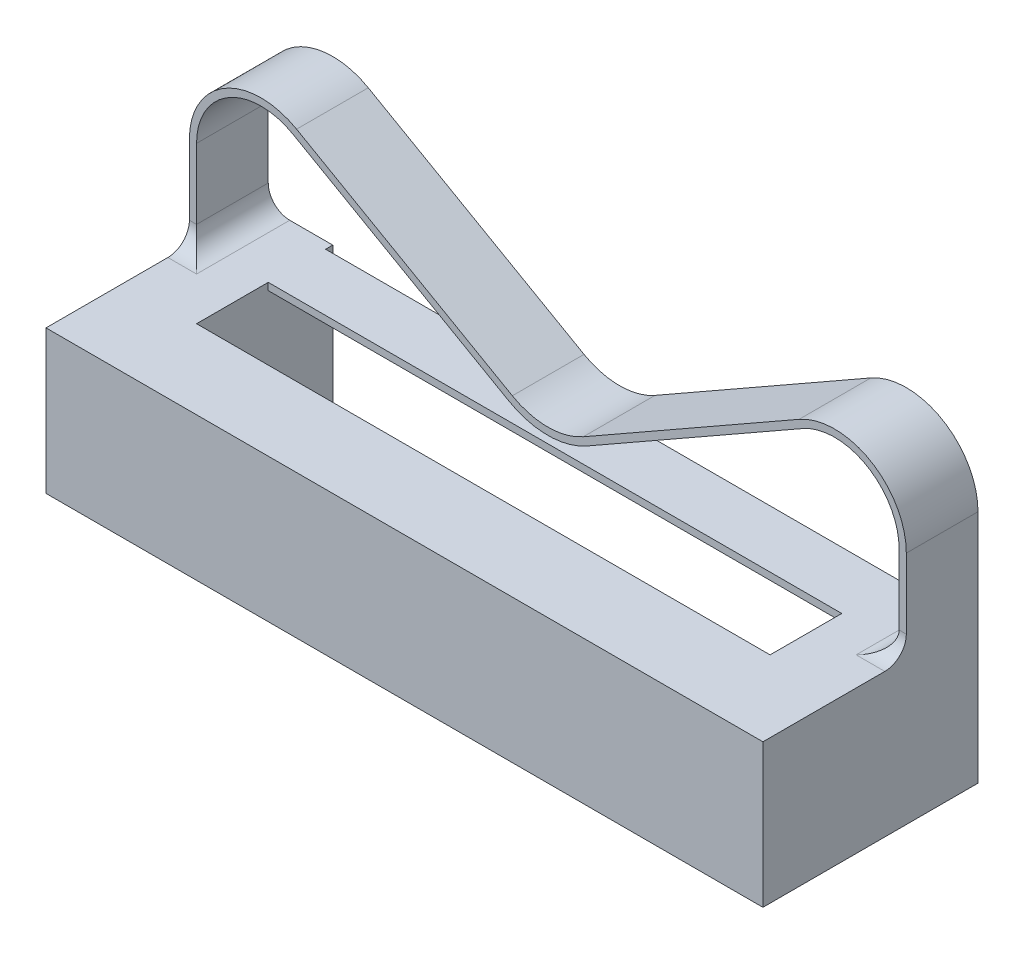
ISO-10303-21;
HEADER;
FILE_DESCRIPTION(('STEP AP214'),'2;1');
FILE_NAME('part.step','',(''),(''),'','','');
FILE_SCHEMA(('AUTOMOTIVE_DESIGN { 1 0 10303 214 1 1 1 1 }'));
ENDSEC;
DATA;
#1=APPLICATION_CONTEXT('core data for automotive mechanical design processes');
#2=APPLICATION_PROTOCOL_DEFINITION('international standard','automotive_design',2000,#1);
#3=PRODUCT_CONTEXT('',#1,'mechanical');
#4=PRODUCT('Part','Part','',(#3));
#5=PRODUCT_RELATED_PRODUCT_CATEGORY('part','',(#4));
#6=PRODUCT_DEFINITION_FORMATION('','',#4);
#7=PRODUCT_DEFINITION_CONTEXT('part definition',#1,'design');
#8=PRODUCT_DEFINITION('design','',#6,#7);
#9=PRODUCT_DEFINITION_SHAPE('','',#8);
#10=(LENGTH_UNIT() NAMED_UNIT(*) SI_UNIT(.MILLI.,.METRE.));
#11=(NAMED_UNIT(*) PLANE_ANGLE_UNIT() SI_UNIT($,.RADIAN.));
#12=(NAMED_UNIT(*) SI_UNIT($,.STERADIAN.) SOLID_ANGLE_UNIT());
#13=UNCERTAINTY_MEASURE_WITH_UNIT(LENGTH_MEASURE(1.E-05),#10,'distance_accuracy_value','');
#14=(GEOMETRIC_REPRESENTATION_CONTEXT(3) GLOBAL_UNCERTAINTY_ASSIGNED_CONTEXT((#13)) GLOBAL_UNIT_ASSIGNED_CONTEXT((#10,
#11,#12)) REPRESENTATION_CONTEXT('',''));
#15=CARTESIAN_POINT('',(0.,0.,0.));
#16=DIRECTION('',(0.,0.,1.));
#17=DIRECTION('',(1.,0.,0.));
#18=AXIS2_PLACEMENT_3D('',#15,#16,#17);
#19=CARTESIAN_POINT('',(0.,20.,50.));
#20=DIRECTION('',(0.,1.,0.));
#21=DIRECTION('',(0.,0.,1.));
#22=AXIS2_PLACEMENT_3D('',#19,#20,#21);
#23=PLANE('',#22);
#24=DIRECTION('',(0.,0.,-1.));
#25=VECTOR('',#24,1.);
#26=CARTESIAN_POINT('',(100.,20.,50.));
#27=LINE('',#26,#25);
#28=CARTESIAN_POINT('',(100.,20.,50.));
#29=VERTEX_POINT('',#28);
#30=CARTESIAN_POINT('',(100.,20.,33.));
#31=VERTEX_POINT('',#30);
#32=EDGE_CURVE('E270',#29,#31,#27,.T.);
#33=ORIENTED_EDGE('',*,*,#32,.T.);
#34=DIRECTION('',(-1.,0.,0.));
#35=VECTOR('',#34,1.);
#36=CARTESIAN_POINT('',(99.,20.,33.));
#37=LINE('',#36,#35);
#38=CARTESIAN_POINT('',(96.,20.,33.));
#39=VERTEX_POINT('',#38);
#40=EDGE_CURVE('E286',#31,#39,#37,.T.);
#41=ORIENTED_EDGE('',*,*,#40,.T.);
#42=DIRECTION('',(0.,0.,1.));
#43=VECTOR('',#42,1.);
#44=CARTESIAN_POINT('',(96.,20.,50.));
#45=LINE('',#44,#43);
#46=CARTESIAN_POINT('',(96.,20.,20.));
#47=VERTEX_POINT('',#46);
#48=EDGE_CURVE('E284',#39,#47,#45,.F.);
#49=ORIENTED_EDGE('',*,*,#48,.T.);
#50=DIRECTION('',(1.,0.,0.));
#51=VECTOR('',#50,1.);
#52=CARTESIAN_POINT('',(100.,20.,20.));
#53=LINE('',#52,#51);
#54=CARTESIAN_POINT('',(90.,20.,20.));
#55=VERTEX_POINT('',#54);
#56=EDGE_CURVE('E322',#55,#47,#53,.T.);
#57=ORIENTED_EDGE('',*,*,#56,.F.);
#58=DIRECTION('',(0.,0.,1.));
#59=VECTOR('',#58,1.);
#60=CARTESIAN_POINT('',(90.,20.,11.));
#61=LINE('',#60,#59);
#62=CARTESIAN_POINT('',(90.,20.,21.));
#63=VERTEX_POINT('',#62);
#64=EDGE_CURVE('E463',#55,#63,#61,.T.);
#65=ORIENTED_EDGE('',*,*,#64,.T.);
#66=DIRECTION('',(-1.,0.,0.));
#67=VECTOR('',#66,1.);
#68=CARTESIAN_POINT('',(9.99999999999997,20.,21.));
#69=LINE('',#68,#67);
#70=CARTESIAN_POINT('',(9.99999999999997,20.,21.));
#71=VERTEX_POINT('',#70);
#72=EDGE_CURVE('E465',#63,#71,#69,.T.);
#73=ORIENTED_EDGE('',*,*,#72,.T.);
#74=DIRECTION('',(0.,0.,-1.));
#75=VECTOR('',#74,1.);
#76=CARTESIAN_POINT('',(9.99999999999997,20.,11.));
#77=LINE('',#76,#75);
#78=CARTESIAN_POINT('',(9.99999999999998,20.,20.));
#79=VERTEX_POINT('',#78);
#80=EDGE_CURVE('E320',#71,#79,#77,.T.);
#81=ORIENTED_EDGE('',*,*,#80,.T.);
#82=CARTESIAN_POINT('',(4.,20.,20.));
#83=VERTEX_POINT('',#82);
#84=EDGE_CURVE('E317',#83,#79,#53,.T.);
#85=ORIENTED_EDGE('',*,*,#84,.F.);
#86=DIRECTION('',(0.,0.,1.));
#87=VECTOR('',#86,1.);
#88=CARTESIAN_POINT('',(4.,20.,50.));
#89=LINE('',#88,#87);
#90=CARTESIAN_POINT('',(4.,20.,33.));
#91=VERTEX_POINT('',#90);
#92=EDGE_CURVE('E281',#83,#91,#89,.T.);
#93=ORIENTED_EDGE('',*,*,#92,.T.);
#94=DIRECTION('',(-1.,0.,0.));
#95=VECTOR('',#94,1.);
#96=CARTESIAN_POINT('',(0.,20.,33.));
#97=LINE('',#96,#95);
#98=CARTESIAN_POINT('',(0.,20.,33.));
#99=VERTEX_POINT('',#98);
#100=EDGE_CURVE('E267',#91,#99,#97,.T.);
#101=ORIENTED_EDGE('',*,*,#100,.T.);
#102=DIRECTION('',(0.,0.,-1.));
#103=VECTOR('',#102,1.);
#104=CARTESIAN_POINT('',(0.,20.,50.));
#105=LINE('',#104,#103);
#106=CARTESIAN_POINT('',(0.,20.,50.));
#107=VERTEX_POINT('',#106);
#108=EDGE_CURVE('E277',#107,#99,#105,.T.);
#109=ORIENTED_EDGE('',*,*,#108,.F.);
#110=DIRECTION('',(1.,0.,0.));
#111=VECTOR('',#110,1.);
#112=CARTESIAN_POINT('',(0.,20.,50.));
#113=LINE('',#112,#111);
#114=EDGE_CURVE('E473',#107,#29,#113,.T.);
#115=ORIENTED_EDGE('',*,*,#114,.T.);
#116=EDGE_LOOP('',(#33,#41,#49,#57,#65,#73,#81,#85,#93,#101,#109,#115));
#117=FACE_BOUND('',#116,.T.);
#118=DIRECTION('',(0.,0.,1.));
#119=VECTOR('',#118,1.);
#120=CARTESIAN_POINT('',(90.,20.,39.));
#121=LINE('',#120,#119);
#122=CARTESIAN_POINT('',(90.,20.,29.));
#123=VERTEX_POINT('',#122);
#124=CARTESIAN_POINT('',(90.,20.,39.));
#125=VERTEX_POINT('',#124);
#126=EDGE_CURVE('E430',#123,#125,#121,.T.);
#127=ORIENTED_EDGE('',*,*,#126,.T.);
#128=DIRECTION('',(-1.,0.,0.));
#129=VECTOR('',#128,1.);
#130=CARTESIAN_POINT('',(9.99999999999997,20.,39.));
#131=LINE('',#130,#129);
#132=CARTESIAN_POINT('',(9.99999999999997,20.,39.));
#133=VERTEX_POINT('',#132);
#134=EDGE_CURVE('E433',#125,#133,#131,.T.);
#135=ORIENTED_EDGE('',*,*,#134,.T.);
#136=DIRECTION('',(0.,0.,-1.));
#137=VECTOR('',#136,1.);
#138=CARTESIAN_POINT('',(9.99999999999997,20.,39.));
#139=LINE('',#138,#137);
#140=CARTESIAN_POINT('',(9.99999999999997,20.,29.));
#141=VERTEX_POINT('',#140);
#142=EDGE_CURVE('E437',#133,#141,#139,.T.);
#143=ORIENTED_EDGE('',*,*,#142,.T.);
#144=DIRECTION('',(1.,0.,0.));
#145=VECTOR('',#144,1.);
#146=CARTESIAN_POINT('',(9.99999999999997,20.,29.));
#147=LINE('',#146,#145);
#148=EDGE_CURVE('E440',#141,#123,#147,.T.);
#149=ORIENTED_EDGE('',*,*,#148,.T.);
#150=EDGE_LOOP('',(#127,#135,#143,#149));
#151=FACE_BOUND('',#150,.T.);
#152=ADVANCED_FACE('F42',(#117,#151),#23,.T.);
#153=CARTESIAN_POINT('',(0.,0.,50.));
#154=DIRECTION('',(-1.,0.,0.));
#155=DIRECTION('',(0.,0.,1.));
#156=AXIS2_PLACEMENT_3D('',#153,#154,#155);
#157=PLANE('',#156);
#158=DIRECTION('',(0.,-1.,0.));
#159=VECTOR('',#158,1.);
#160=CARTESIAN_POINT('',(0.,20.,20.));
#161=LINE('',#160,#159);
#162=CARTESIAN_POINT('',(0.,32.7895699472174,20.));
#163=VERTEX_POINT('',#162);
#164=CARTESIAN_POINT('',(0.,0.,20.));
#165=VERTEX_POINT('',#164);
#166=EDGE_CURVE('E236',#163,#165,#161,.T.);
#167=ORIENTED_EDGE('',*,*,#166,.T.);
#168=DIRECTION('',(0.,0.,-1.));
#169=VECTOR('',#168,1.);
#170=CARTESIAN_POINT('',(0.,0.,50.));
#171=LINE('',#170,#169);
#172=CARTESIAN_POINT('',(0.,0.,50.));
#173=VERTEX_POINT('',#172);
#174=EDGE_CURVE('E241',#173,#165,#171,.T.);
#175=ORIENTED_EDGE('',*,*,#174,.F.);
#176=DIRECTION('',(0.,1.,0.));
#177=VECTOR('',#176,1.);
#178=CARTESIAN_POINT('',(0.,0.,50.));
#179=LINE('',#178,#177);
#180=EDGE_CURVE('E454',#173,#107,#179,.T.);
#181=ORIENTED_EDGE('',*,*,#180,.T.);
#182=ORIENTED_EDGE('',*,*,#108,.T.);
#183=CARTESIAN_POINT('',(0.,23.,33.));
#184=DIRECTION('',(-1.,0.,0.));
#185=DIRECTION('',(0.,0.,1.));
#186=AXIS2_PLACEMENT_3D('',#183,#184,#185);
#187=CIRCLE('',#186,3.);
#188=CARTESIAN_POINT('',(0.,23.,30.));
#189=VERTEX_POINT('',#188);
#190=EDGE_CURVE('E13',#99,#189,#187,.F.);
#191=ORIENTED_EDGE('',*,*,#190,.T.);
#192=DIRECTION('',(0.,-1.,0.));
#193=VECTOR('',#192,1.);
#194=CARTESIAN_POINT('',(0.,20.,30.));
#195=LINE('',#194,#193);
#196=CARTESIAN_POINT('',(0.,32.7895699472174,30.));
#197=VERTEX_POINT('',#196);
#198=EDGE_CURVE('E325',#197,#189,#195,.T.);
#199=ORIENTED_EDGE('',*,*,#198,.F.);
#200=DIRECTION('',(0.,0.,1.));
#201=VECTOR('',#200,1.);
#202=CARTESIAN_POINT('',(0.,32.7895699472174,20.));
#203=LINE('',#202,#201);
#204=EDGE_CURVE('E244',#163,#197,#203,.T.);
#205=ORIENTED_EDGE('',*,*,#204,.F.);
#206=EDGE_LOOP('',(#167,#175,#181,#182,#191,#199,#205));
#207=FACE_BOUND('',#206,.T.);
#208=ADVANCED_FACE('F238',(#207),#157,.T.);
#209=CARTESIAN_POINT('',(0.,0.,50.));
#210=DIRECTION('',(0.,1.,0.));
#211=DIRECTION('',(0.,0.,1.));
#212=AXIS2_PLACEMENT_3D('',#209,#210,#211);
#213=PLANE('',#212);
#214=ORIENTED_EDGE('',*,*,#174,.T.);
#215=DIRECTION('',(-1.,0.,0.));
#216=VECTOR('',#215,1.);
#217=CARTESIAN_POINT('',(100.,0.,20.));
#218=LINE('',#217,#216);
#219=CARTESIAN_POINT('',(9.99999999999998,0.,20.));
#220=VERTEX_POINT('',#219);
#221=EDGE_CURVE('E251',#220,#165,#218,.T.);
#222=ORIENTED_EDGE('',*,*,#221,.F.);
#223=DIRECTION('',(0.,0.,-1.));
#224=VECTOR('',#223,1.);
#225=CARTESIAN_POINT('',(9.99999999999997,0.,39.));
#226=LINE('',#225,#224);
#227=CARTESIAN_POINT('',(9.99999999999997,0.,39.));
#228=VERTEX_POINT('',#227);
#229=EDGE_CURVE('E434',#228,#220,#226,.T.);
#230=ORIENTED_EDGE('',*,*,#229,.F.);
#231=DIRECTION('',(-1.,0.,0.));
#232=VECTOR('',#231,1.);
#233=CARTESIAN_POINT('',(9.99999999999997,0.,39.));
#234=LINE('',#233,#232);
#235=CARTESIAN_POINT('',(90.,0.,39.));
#236=VERTEX_POINT('',#235);
#237=EDGE_CURVE('E446',#236,#228,#234,.T.);
#238=ORIENTED_EDGE('',*,*,#237,.F.);
#239=DIRECTION('',(0.,0.,1.));
#240=VECTOR('',#239,1.);
#241=CARTESIAN_POINT('',(90.,0.,39.));
#242=LINE('',#241,#240);
#243=CARTESIAN_POINT('',(90.,0.,20.));
#244=VERTEX_POINT('',#243);
#245=EDGE_CURVE('E444',#244,#236,#242,.T.);
#246=ORIENTED_EDGE('',*,*,#245,.F.);
#247=CARTESIAN_POINT('',(100.,0.,20.));
#248=VERTEX_POINT('',#247);
#249=EDGE_CURVE('E258',#248,#244,#218,.T.);
#250=ORIENTED_EDGE('',*,*,#249,.F.);
#251=DIRECTION('',(0.,0.,-1.));
#252=VECTOR('',#251,1.);
#253=CARTESIAN_POINT('',(100.,0.,50.));
#254=LINE('',#253,#252);
#255=CARTESIAN_POINT('',(100.,0.,50.));
#256=VERTEX_POINT('',#255);
#257=EDGE_CURVE('E265',#256,#248,#254,.T.);
#258=ORIENTED_EDGE('',*,*,#257,.F.);
#259=DIRECTION('',(1.,0.,0.));
#260=VECTOR('',#259,1.);
#261=CARTESIAN_POINT('',(0.,0.,50.));
#262=LINE('',#261,#260);
#263=EDGE_CURVE('E263',#173,#256,#262,.T.);
#264=ORIENTED_EDGE('',*,*,#263,.F.);
#265=EDGE_LOOP('',(#214,#222,#230,#238,#246,#250,#258,#264));
#266=FACE_BOUND('',#265,.T.);
#267=ADVANCED_FACE('F261',(#266),#213,.F.);
#268=CARTESIAN_POINT('',(100.,20.,50.));
#269=DIRECTION('',(1.,0.,0.));
#270=DIRECTION('',(0.,0.,-1.));
#271=AXIS2_PLACEMENT_3D('',#268,#269,#270);
#272=PLANE('',#271);
#273=ORIENTED_EDGE('',*,*,#257,.T.);
#274=DIRECTION('',(0.,1.,0.));
#275=VECTOR('',#274,1.);
#276=CARTESIAN_POINT('',(100.,20.,20.));
#277=LINE('',#276,#275);
#278=CARTESIAN_POINT('',(100.,32.7895699472174,20.));
#279=VERTEX_POINT('',#278);
#280=EDGE_CURVE('E378',#248,#279,#277,.T.);
#281=ORIENTED_EDGE('',*,*,#280,.T.);
#282=DIRECTION('',(0.,0.,1.));
#283=VECTOR('',#282,1.);
#284=CARTESIAN_POINT('',(100.,32.7895699472174,20.));
#285=LINE('',#284,#283);
#286=CARTESIAN_POINT('',(100.,32.7895699472174,30.));
#287=VERTEX_POINT('',#286);
#288=EDGE_CURVE('E406',#279,#287,#285,.T.);
#289=ORIENTED_EDGE('',*,*,#288,.T.);
#290=DIRECTION('',(0.,1.,0.));
#291=VECTOR('',#290,1.);
#292=CARTESIAN_POINT('',(100.,20.,30.));
#293=LINE('',#292,#291);
#294=CARTESIAN_POINT('',(100.,23.,30.));
#295=VERTEX_POINT('',#294);
#296=EDGE_CURVE('E349',#295,#287,#293,.T.);
#297=ORIENTED_EDGE('',*,*,#296,.F.);
#298=CARTESIAN_POINT('',(100.,23.,33.));
#299=DIRECTION('',(1.,0.,0.));
#300=DIRECTION('',(0.,0.,-1.));
#301=AXIS2_PLACEMENT_3D('',#298,#299,#300);
#302=CIRCLE('',#301,3.);
#303=EDGE_CURVE('E296',#295,#31,#302,.F.);
#304=ORIENTED_EDGE('',*,*,#303,.T.);
#305=ORIENTED_EDGE('',*,*,#32,.F.);
#306=DIRECTION('',(0.,-1.,0.));
#307=VECTOR('',#306,1.);
#308=CARTESIAN_POINT('',(100.,20.,50.));
#309=LINE('',#308,#307);
#310=EDGE_CURVE('E475',#29,#256,#309,.T.);
#311=ORIENTED_EDGE('',*,*,#310,.T.);
#312=EDGE_LOOP('',(#273,#281,#289,#297,#304,#305,#311));
#313=FACE_BOUND('',#312,.T.);
#314=ADVANCED_FACE('F484',(#313),#272,.T.);
#315=CARTESIAN_POINT('',(0.,0.,50.));
#316=DIRECTION('',(0.,0.,-1.));
#317=DIRECTION('',(-1.,0.,0.));
#318=AXIS2_PLACEMENT_3D('',#315,#316,#317);
#319=PLANE('',#318);
#320=ORIENTED_EDGE('',*,*,#180,.F.);
#321=ORIENTED_EDGE('',*,*,#263,.T.);
#322=ORIENTED_EDGE('',*,*,#310,.F.);
#323=ORIENTED_EDGE('',*,*,#114,.F.);
#324=EDGE_LOOP('',(#320,#321,#322,#323));
#325=FACE_BOUND('',#324,.T.);
#326=ADVANCED_FACE('F480',(#325),#319,.F.);
#327=CARTESIAN_POINT('',(9.99999999999997,20.,21.));
#328=DIRECTION('',(0.,0.,1.));
#329=DIRECTION('',(1.,0.,0.));
#330=AXIS2_PLACEMENT_3D('',#327,#328,#329);
#331=PLANE('',#330);
#332=DIRECTION('',(0.,-1.,0.));
#333=VECTOR('',#332,1.);
#334=CARTESIAN_POINT('',(90.,20.,21.));
#335=LINE('',#334,#333);
#336=CARTESIAN_POINT('',(90.,19.,21.));
#337=VERTEX_POINT('',#336);
#338=EDGE_CURVE('E467',#63,#337,#335,.T.);
#339=ORIENTED_EDGE('',*,*,#338,.T.);
#340=DIRECTION('',(-1.,0.,0.));
#341=VECTOR('',#340,1.);
#342=CARTESIAN_POINT('',(9.99999999999997,19.,21.));
#343=LINE('',#342,#341);
#344=CARTESIAN_POINT('',(10.,19.,21.));
#345=VERTEX_POINT('',#344);
#346=EDGE_CURVE('E427',#337,#345,#343,.T.);
#347=ORIENTED_EDGE('',*,*,#346,.T.);
#348=DIRECTION('',(0.,-1.,0.));
#349=VECTOR('',#348,1.);
#350=CARTESIAN_POINT('',(9.99999999999997,20.,21.));
#351=LINE('',#350,#349);
#352=EDGE_CURVE('E447',#71,#345,#351,.T.);
#353=ORIENTED_EDGE('',*,*,#352,.F.);
#354=ORIENTED_EDGE('',*,*,#72,.F.);
#355=EDGE_LOOP('',(#339,#347,#353,#354));
#356=FACE_BOUND('',#355,.T.);
#357=ADVANCED_FACE('F674',(#356),#331,.F.);
#358=CARTESIAN_POINT('',(90.,20.,39.));
#359=DIRECTION('',(1.,0.,0.));
#360=DIRECTION('',(0.,0.,-1.));
#361=AXIS2_PLACEMENT_3D('',#358,#359,#360);
#362=PLANE('',#361);
#363=ORIENTED_EDGE('',*,*,#64,.F.);
#364=DIRECTION('',(0.,-1.,0.));
#365=VECTOR('',#364,1.);
#366=CARTESIAN_POINT('',(90.,20.,20.));
#367=LINE('',#366,#365);
#368=EDGE_CURVE('E321',#55,#244,#367,.T.);
#369=ORIENTED_EDGE('',*,*,#368,.T.);
#370=ORIENTED_EDGE('',*,*,#245,.T.);
#371=DIRECTION('',(0.,-1.,0.));
#372=VECTOR('',#371,1.);
#373=CARTESIAN_POINT('',(90.,20.,39.));
#374=LINE('',#373,#372);
#375=EDGE_CURVE('E443',#125,#236,#374,.T.);
#376=ORIENTED_EDGE('',*,*,#375,.F.);
#377=ORIENTED_EDGE('',*,*,#126,.F.);
#378=DIRECTION('',(0.,-1.,0.));
#379=VECTOR('',#378,1.);
#380=CARTESIAN_POINT('',(90.,20.,29.));
#381=LINE('',#380,#379);
#382=CARTESIAN_POINT('',(90.,19.,29.));
#383=VERTEX_POINT('',#382);
#384=EDGE_CURVE('E451',#123,#383,#381,.T.);
#385=ORIENTED_EDGE('',*,*,#384,.T.);
#386=DIRECTION('',(0.,0.,1.));
#387=VECTOR('',#386,1.);
#388=CARTESIAN_POINT('',(90.,19.,34.));
#389=LINE('',#388,#387);
#390=EDGE_CURVE('E421',#337,#383,#389,.T.);
#391=ORIENTED_EDGE('',*,*,#390,.F.);
#392=ORIENTED_EDGE('',*,*,#338,.F.);
#393=EDGE_LOOP('',(#363,#369,#370,#376,#377,#385,#391,#392));
#394=FACE_BOUND('',#393,.T.);
#395=ADVANCED_FACE('F664',(#394),#362,.F.);
#396=CARTESIAN_POINT('',(9.99999999999997,20.,29.));
#397=DIRECTION('',(0.,0.,-1.));
#398=DIRECTION('',(-1.,0.,0.));
#399=AXIS2_PLACEMENT_3D('',#396,#397,#398);
#400=PLANE('',#399);
#401=DIRECTION('',(0.,-1.,0.));
#402=VECTOR('',#401,1.);
#403=CARTESIAN_POINT('',(9.99999999999997,20.,29.));
#404=LINE('',#403,#402);
#405=CARTESIAN_POINT('',(10.,19.,29.));
#406=VERTEX_POINT('',#405);
#407=EDGE_CURVE('E455',#141,#406,#404,.T.);
#408=ORIENTED_EDGE('',*,*,#407,.T.);
#409=DIRECTION('',(1.,0.,0.));
#410=VECTOR('',#409,1.);
#411=CARTESIAN_POINT('',(9.99999999999997,19.,29.));
#412=LINE('',#411,#410);
#413=EDGE_CURVE('E423',#406,#383,#412,.T.);
#414=ORIENTED_EDGE('',*,*,#413,.T.);
#415=ORIENTED_EDGE('',*,*,#384,.F.);
#416=ORIENTED_EDGE('',*,*,#148,.F.);
#417=EDGE_LOOP('',(#408,#414,#415,#416));
#418=FACE_BOUND('',#417,.T.);
#419=ADVANCED_FACE('F658',(#418),#400,.F.);
#420=CARTESIAN_POINT('',(9.99999999999997,20.,39.));
#421=DIRECTION('',(-1.,0.,0.));
#422=DIRECTION('',(0.,0.,1.));
#423=AXIS2_PLACEMENT_3D('',#420,#421,#422);
#424=PLANE('',#423);
#425=ORIENTED_EDGE('',*,*,#229,.T.);
#426=DIRECTION('',(0.,1.,0.));
#427=VECTOR('',#426,1.);
#428=CARTESIAN_POINT('',(9.99999999999997,20.,20.));
#429=LINE('',#428,#427);
#430=EDGE_CURVE('E254',#220,#79,#429,.T.);
#431=ORIENTED_EDGE('',*,*,#430,.T.);
#432=ORIENTED_EDGE('',*,*,#80,.F.);
#433=ORIENTED_EDGE('',*,*,#352,.T.);
#434=DIRECTION('',(0.,0.,-1.));
#435=VECTOR('',#434,1.);
#436=CARTESIAN_POINT('',(10.,19.,34.));
#437=LINE('',#436,#435);
#438=EDGE_CURVE('E397',#406,#345,#437,.T.);
#439=ORIENTED_EDGE('',*,*,#438,.F.);
#440=ORIENTED_EDGE('',*,*,#407,.F.);
#441=ORIENTED_EDGE('',*,*,#142,.F.);
#442=DIRECTION('',(0.,-1.,0.));
#443=VECTOR('',#442,1.);
#444=CARTESIAN_POINT('',(9.99999999999997,20.,39.));
#445=LINE('',#444,#443);
#446=EDGE_CURVE('E458',#133,#228,#445,.T.);
#447=ORIENTED_EDGE('',*,*,#446,.T.);
#448=EDGE_LOOP('',(#425,#431,#432,#433,#439,#440,#441,#447));
#449=FACE_BOUND('',#448,.T.);
#450=ADVANCED_FACE('F663',(#449),#424,.F.);
#451=CARTESIAN_POINT('',(9.99999999999997,20.,39.));
#452=DIRECTION('',(0.,0.,1.));
#453=DIRECTION('',(1.,0.,0.));
#454=AXIS2_PLACEMENT_3D('',#451,#452,#453);
#455=PLANE('',#454);
#456=ORIENTED_EDGE('',*,*,#237,.T.);
#457=ORIENTED_EDGE('',*,*,#446,.F.);
#458=ORIENTED_EDGE('',*,*,#134,.F.);
#459=ORIENTED_EDGE('',*,*,#375,.T.);
#460=EDGE_LOOP('',(#456,#457,#458,#459));
#461=FACE_BOUND('',#460,.T.);
#462=ADVANCED_FACE('F516',(#461),#455,.F.);
#463=CARTESIAN_POINT('',(0.,19.,50.));
#464=DIRECTION('',(0.,1.,0.));
#465=DIRECTION('',(0.,0.,1.));
#466=AXIS2_PLACEMENT_3D('',#463,#464,#465);
#467=PLANE('',#466);
#468=ORIENTED_EDGE('',*,*,#390,.T.);
#469=ORIENTED_EDGE('',*,*,#413,.F.);
#470=ORIENTED_EDGE('',*,*,#438,.T.);
#471=ORIENTED_EDGE('',*,*,#346,.F.);
#472=EDGE_LOOP('',(#468,#469,#470,#471));
#473=FACE_BOUND('',#472,.T.);
#474=ADVANCED_FACE('F509',(#473),#467,.F.);
#475=CARTESIAN_POINT('',(10.,32.7895699472174,20.));
#476=DIRECTION('',(0.,0.,1.));
#477=DIRECTION('',(1.,0.,0.));
#478=AXIS2_PLACEMENT_3D('',#475,#476,#477);
#479=CYLINDRICAL_SURFACE('',#478,10.);
#480=ORIENTED_EDGE('',*,*,#204,.T.);
#481=CARTESIAN_POINT('',(10.,32.7895699472174,30.));
#482=DIRECTION('',(0.,0.,1.));
#483=DIRECTION('',(1.,0.,0.));
#484=AXIS2_PLACEMENT_3D('',#481,#482,#483);
#485=CIRCLE('',#484,10.);
#486=CARTESIAN_POINT('',(14.9520304400982,41.477342649144,30.));
#487=VERTEX_POINT('',#486);
#488=EDGE_CURVE('E248',#487,#197,#485,.T.);
#489=ORIENTED_EDGE('',*,*,#488,.F.);
#490=DIRECTION('',(0.,0.,1.));
#491=VECTOR('',#490,1.);
#492=CARTESIAN_POINT('',(14.9520304400982,41.477342649144,20.));
#493=LINE('',#492,#491);
#494=CARTESIAN_POINT('',(14.9520304400982,41.477342649144,20.));
#495=VERTEX_POINT('',#494);
#496=EDGE_CURVE('E398',#495,#487,#493,.T.);
#497=ORIENTED_EDGE('',*,*,#496,.F.);
#498=CARTESIAN_POINT('',(10.,32.7895699472174,20.));
#499=DIRECTION('',(0.,0.,1.));
#500=DIRECTION('',(1.,0.,0.));
#501=AXIS2_PLACEMENT_3D('',#498,#499,#500);
#502=CIRCLE('',#501,10.);
#503=EDGE_CURVE('E393',#495,#163,#502,.T.);
#504=ORIENTED_EDGE('',*,*,#503,.T.);
#505=EDGE_LOOP('',(#480,#489,#497,#504));
#506=FACE_BOUND('',#505,.T.);
#507=ADVANCED_FACE('F507',(#506),#479,.T.);
#508=CARTESIAN_POINT('',(45.0479695599018,24.322657350856,20.));
#509=DIRECTION('',(0.495203044009817,0.868777270192661,0.));
#510=DIRECTION('',(-0.868777270192661,0.495203044009817,0.));
#511=AXIS2_PLACEMENT_3D('',#508,#509,#510);
#512=PLANE('',#511);
#513=ORIENTED_EDGE('',*,*,#496,.T.);
#514=DIRECTION('',(-0.868777270192661,0.495203044009817,0.));
#515=VECTOR('',#514,1.);
#516=CARTESIAN_POINT('',(45.0479695599018,24.322657350856,30.));
#517=LINE('',#516,#515);
#518=CARTESIAN_POINT('',(45.0479695599018,24.322657350856,30.));
#519=VERTEX_POINT('',#518);
#520=EDGE_CURVE('E360',#519,#487,#517,.T.);
#521=ORIENTED_EDGE('',*,*,#520,.F.);
#522=DIRECTION('',(0.,0.,1.));
#523=VECTOR('',#522,1.);
#524=CARTESIAN_POINT('',(45.0479695599018,24.322657350856,20.));
#525=LINE('',#524,#523);
#526=CARTESIAN_POINT('',(45.0479695599018,24.322657350856,20.));
#527=VERTEX_POINT('',#526);
#528=EDGE_CURVE('E400',#527,#519,#525,.T.);
#529=ORIENTED_EDGE('',*,*,#528,.F.);
#530=DIRECTION('',(-0.868777270192661,0.495203044009817,0.));
#531=VECTOR('',#530,1.);
#532=CARTESIAN_POINT('',(45.0479695599018,24.322657350856,20.));
#533=LINE('',#532,#531);
#534=EDGE_CURVE('E390',#527,#495,#533,.T.);
#535=ORIENTED_EDGE('',*,*,#534,.T.);
#536=EDGE_LOOP('',(#513,#521,#529,#535));
#537=FACE_BOUND('',#536,.T.);
#538=ADVANCED_FACE('F503',(#537),#512,.T.);
#539=CARTESIAN_POINT('',(50.,33.0104300527826,20.));
#540=DIRECTION('',(0.,0.,1.));
#541=DIRECTION('',(1.,0.,0.));
#542=AXIS2_PLACEMENT_3D('',#539,#540,#541);
#543=CYLINDRICAL_SURFACE('',#542,10.);
#544=ORIENTED_EDGE('',*,*,#528,.T.);
#545=CARTESIAN_POINT('',(50.,33.0104300527826,30.));
#546=DIRECTION('',(0.,0.,-1.));
#547=DIRECTION('',(-1.,0.,0.));
#548=AXIS2_PLACEMENT_3D('',#545,#546,#547);
#549=CIRCLE('',#548,10.);
#550=CARTESIAN_POINT('',(54.9520304400982,24.322657350856,30.));
#551=VERTEX_POINT('',#550);
#552=EDGE_CURVE('E357',#551,#519,#549,.T.);
#553=ORIENTED_EDGE('',*,*,#552,.F.);
#554=DIRECTION('',(0.,0.,1.));
#555=VECTOR('',#554,1.);
#556=CARTESIAN_POINT('',(54.9520304400982,24.322657350856,20.));
#557=LINE('',#556,#555);
#558=CARTESIAN_POINT('',(54.9520304400982,24.322657350856,20.));
#559=VERTEX_POINT('',#558);
#560=EDGE_CURVE('E402',#559,#551,#557,.T.);
#561=ORIENTED_EDGE('',*,*,#560,.F.);
#562=CARTESIAN_POINT('',(50.,33.0104300527826,20.));
#563=DIRECTION('',(0.,0.,-1.));
#564=DIRECTION('',(-1.,0.,0.));
#565=AXIS2_PLACEMENT_3D('',#562,#563,#564);
#566=CIRCLE('',#565,10.);
#567=EDGE_CURVE('E387',#559,#527,#566,.T.);
#568=ORIENTED_EDGE('',*,*,#567,.T.);
#569=EDGE_LOOP('',(#544,#553,#561,#568));
#570=FACE_BOUND('',#569,.T.);
#571=ADVANCED_FACE('F500',(#570),#543,.F.);
#572=CARTESIAN_POINT('',(85.0479695599018,41.477342649144,20.));
#573=DIRECTION('',(-0.495203044009817,0.868777270192661,0.));
#574=DIRECTION('',(-0.868777270192661,-0.495203044009817,0.));
#575=AXIS2_PLACEMENT_3D('',#572,#573,#574);
#576=PLANE('',#575);
#577=ORIENTED_EDGE('',*,*,#560,.T.);
#578=DIRECTION('',(-0.868777270192661,-0.495203044009817,0.));
#579=VECTOR('',#578,1.);
#580=CARTESIAN_POINT('',(85.0479695599018,41.477342649144,30.));
#581=LINE('',#580,#579);
#582=CARTESIAN_POINT('',(85.0479695599018,41.477342649144,30.));
#583=VERTEX_POINT('',#582);
#584=EDGE_CURVE('E354',#583,#551,#581,.T.);
#585=ORIENTED_EDGE('',*,*,#584,.F.);
#586=DIRECTION('',(0.,0.,1.));
#587=VECTOR('',#586,1.);
#588=CARTESIAN_POINT('',(85.0479695599018,41.477342649144,20.));
#589=LINE('',#588,#587);
#590=CARTESIAN_POINT('',(85.0479695599018,41.477342649144,20.));
#591=VERTEX_POINT('',#590);
#592=EDGE_CURVE('E404',#591,#583,#589,.T.);
#593=ORIENTED_EDGE('',*,*,#592,.F.);
#594=DIRECTION('',(-0.868777270192661,-0.495203044009817,0.));
#595=VECTOR('',#594,1.);
#596=CARTESIAN_POINT('',(85.0479695599018,41.477342649144,20.));
#597=LINE('',#596,#595);
#598=EDGE_CURVE('E384',#591,#559,#597,.T.);
#599=ORIENTED_EDGE('',*,*,#598,.T.);
#600=EDGE_LOOP('',(#577,#585,#593,#599));
#601=FACE_BOUND('',#600,.T.);
#602=ADVANCED_FACE('F498',(#601),#576,.T.);
#603=CARTESIAN_POINT('',(90.,32.7895699472174,20.));
#604=DIRECTION('',(0.,0.,1.));
#605=DIRECTION('',(1.,0.,0.));
#606=AXIS2_PLACEMENT_3D('',#603,#604,#605);
#607=CYLINDRICAL_SURFACE('',#606,10.);
#608=ORIENTED_EDGE('',*,*,#592,.T.);
#609=CARTESIAN_POINT('',(90.,32.7895699472174,30.));
#610=DIRECTION('',(0.,0.,1.));
#611=DIRECTION('',(1.,0.,0.));
#612=AXIS2_PLACEMENT_3D('',#609,#610,#611);
#613=CIRCLE('',#612,10.);
#614=EDGE_CURVE('E351',#287,#583,#613,.T.);
#615=ORIENTED_EDGE('',*,*,#614,.F.);
#616=ORIENTED_EDGE('',*,*,#288,.F.);
#617=CARTESIAN_POINT('',(90.,32.7895699472174,20.));
#618=DIRECTION('',(0.,0.,1.));
#619=DIRECTION('',(1.,0.,0.));
#620=AXIS2_PLACEMENT_3D('',#617,#618,#619);
#621=CIRCLE('',#620,10.);
#622=EDGE_CURVE('E381',#279,#591,#621,.T.);
#623=ORIENTED_EDGE('',*,*,#622,.T.);
#624=EDGE_LOOP('',(#608,#615,#616,#623));
#625=FACE_BOUND('',#624,.T.);
#626=ADVANCED_FACE('F491',(#625),#607,.T.);
#627=CARTESIAN_POINT('',(99.,20.,20.));
#628=DIRECTION('',(1.,0.,0.));
#629=DIRECTION('',(0.,0.,-1.));
#630=AXIS2_PLACEMENT_3D('',#627,#628,#629);
#631=PLANE('',#630);
#632=DIRECTION('',(0.,1.,0.));
#633=VECTOR('',#632,1.);
#634=CARTESIAN_POINT('',(99.,20.,20.));
#635=LINE('',#634,#633);
#636=CARTESIAN_POINT('',(99.,23.,20.));
#637=VERTEX_POINT('',#636);
#638=CARTESIAN_POINT('',(99.,32.7895699472174,20.));
#639=VERTEX_POINT('',#638);
#640=EDGE_CURVE('E376',#637,#639,#635,.T.);
#641=ORIENTED_EDGE('',*,*,#640,.F.);
#642=DIRECTION('',(0.,0.,1.));
#643=VECTOR('',#642,1.);
#644=CARTESIAN_POINT('',(99.,23.,20.));
#645=LINE('',#644,#643);
#646=CARTESIAN_POINT('',(99.,23.,30.));
#647=VERTEX_POINT('',#646);
#648=EDGE_CURVE('E293',#637,#647,#645,.T.);
#649=ORIENTED_EDGE('',*,*,#648,.T.);
#650=DIRECTION('',(0.,1.,0.));
#651=VECTOR('',#650,1.);
#652=CARTESIAN_POINT('',(99.,20.,30.));
#653=LINE('',#652,#651);
#654=CARTESIAN_POINT('',(99.,32.7895699472174,30.));
#655=VERTEX_POINT('',#654);
#656=EDGE_CURVE('E347',#647,#655,#653,.T.);
#657=ORIENTED_EDGE('',*,*,#656,.T.);
#658=DIRECTION('',(0.,0.,1.));
#659=VECTOR('',#658,1.);
#660=CARTESIAN_POINT('',(99.,32.7895699472174,20.));
#661=LINE('',#660,#659);
#662=EDGE_CURVE('E409',#639,#655,#661,.T.);
#663=ORIENTED_EDGE('',*,*,#662,.F.);
#664=EDGE_LOOP('',(#641,#649,#657,#663));
#665=FACE_BOUND('',#664,.T.);
#666=ADVANCED_FACE('F608',(#665),#631,.F.);
#667=CARTESIAN_POINT('',(90.,32.7895699472174,20.));
#668=DIRECTION('',(0.,0.,1.));
#669=DIRECTION('',(1.,0.,0.));
#670=AXIS2_PLACEMENT_3D('',#667,#668,#669);
#671=CYLINDRICAL_SURFACE('',#670,9.00000000000001);
#672=ORIENTED_EDGE('',*,*,#662,.T.);
#673=CARTESIAN_POINT('',(90.,32.7895699472174,30.));
#674=DIRECTION('',(0.,0.,1.));
#675=DIRECTION('',(1.,0.,0.));
#676=AXIS2_PLACEMENT_3D('',#673,#674,#675);
#677=CIRCLE('',#676,9.00000000000001);
#678=CARTESIAN_POINT('',(85.5431726039117,40.6085653789514,30.));
#679=VERTEX_POINT('',#678);
#680=EDGE_CURVE('E344',#655,#679,#677,.T.);
#681=ORIENTED_EDGE('',*,*,#680,.T.);
#682=DIRECTION('',(0.,0.,1.));
#683=VECTOR('',#682,1.);
#684=CARTESIAN_POINT('',(85.5431726039117,40.6085653789514,20.));
#685=LINE('',#684,#683);
#686=CARTESIAN_POINT('',(85.5431726039117,40.6085653789514,20.));
#687=VERTEX_POINT('',#686);
#688=EDGE_CURVE('E412',#687,#679,#685,.T.);
#689=ORIENTED_EDGE('',*,*,#688,.F.);
#690=CARTESIAN_POINT('',(90.,32.7895699472174,20.));
#691=DIRECTION('',(0.,0.,1.));
#692=DIRECTION('',(1.,0.,0.));
#693=AXIS2_PLACEMENT_3D('',#690,#691,#692);
#694=CIRCLE('',#693,9.00000000000001);
#695=EDGE_CURVE('E374',#639,#687,#694,.T.);
#696=ORIENTED_EDGE('',*,*,#695,.F.);
#697=EDGE_LOOP('',(#672,#681,#689,#696));
#698=FACE_BOUND('',#697,.T.);
#699=ADVANCED_FACE('F600',(#698),#671,.F.);
#700=CARTESIAN_POINT('',(85.5431726039117,40.6085653789514,20.));
#701=DIRECTION('',(-0.495203044009817,0.868777270192661,0.));
#702=DIRECTION('',(-0.868777270192661,-0.495203044009817,0.));
#703=AXIS2_PLACEMENT_3D('',#700,#701,#702);
#704=PLANE('',#703);
#705=ORIENTED_EDGE('',*,*,#688,.T.);
#706=DIRECTION('',(-0.868777270192661,-0.495203044009817,0.));
#707=VECTOR('',#706,1.);
#708=CARTESIAN_POINT('',(85.5431726039117,40.6085653789514,30.));
#709=LINE('',#708,#707);
#710=CARTESIAN_POINT('',(55.447233484108,23.4538800806633,30.));
#711=VERTEX_POINT('',#710);
#712=EDGE_CURVE('E341',#679,#711,#709,.T.);
#713=ORIENTED_EDGE('',*,*,#712,.T.);
#714=DIRECTION('',(0.,0.,1.));
#715=VECTOR('',#714,1.);
#716=CARTESIAN_POINT('',(55.447233484108,23.4538800806633,20.));
#717=LINE('',#716,#715);
#718=CARTESIAN_POINT('',(55.447233484108,23.4538800806633,20.));
#719=VERTEX_POINT('',#718);
#720=EDGE_CURVE('E414',#719,#711,#717,.T.);
#721=ORIENTED_EDGE('',*,*,#720,.F.);
#722=DIRECTION('',(-0.868777270192661,-0.495203044009817,0.));
#723=VECTOR('',#722,1.);
#724=CARTESIAN_POINT('',(85.5431726039117,40.6085653789514,20.));
#725=LINE('',#724,#723);
#726=EDGE_CURVE('E372',#687,#719,#725,.T.);
#727=ORIENTED_EDGE('',*,*,#726,.F.);
#728=EDGE_LOOP('',(#705,#713,#721,#727));
#729=FACE_BOUND('',#728,.T.);
#730=ADVANCED_FACE('F592',(#729),#704,.F.);
#731=CARTESIAN_POINT('',(50.,33.0104300527826,20.));
#732=DIRECTION('',(0.,0.,1.));
#733=DIRECTION('',(1.,0.,0.));
#734=AXIS2_PLACEMENT_3D('',#731,#732,#733);
#735=CYLINDRICAL_SURFACE('',#734,11.);
#736=ORIENTED_EDGE('',*,*,#720,.T.);
#737=CARTESIAN_POINT('',(50.,33.0104300527826,30.));
#738=DIRECTION('',(0.,0.,1.));
#739=DIRECTION('',(1.,0.,0.));
#740=AXIS2_PLACEMENT_3D('',#737,#738,#739);
#741=CIRCLE('',#740,11.);
#742=CARTESIAN_POINT('',(44.552766515892,23.4538800806633,30.));
#743=VERTEX_POINT('',#742);
#744=EDGE_CURVE('E338',#711,#743,#741,.F.);
#745=ORIENTED_EDGE('',*,*,#744,.T.);
#746=DIRECTION('',(0.,0.,1.));
#747=VECTOR('',#746,1.);
#748=CARTESIAN_POINT('',(44.552766515892,23.4538800806633,20.));
#749=LINE('',#748,#747);
#750=CARTESIAN_POINT('',(44.552766515892,23.4538800806633,20.));
#751=VERTEX_POINT('',#750);
#752=EDGE_CURVE('E416',#751,#743,#749,.T.);
#753=ORIENTED_EDGE('',*,*,#752,.F.);
#754=CARTESIAN_POINT('',(50.,33.0104300527826,20.));
#755=DIRECTION('',(0.,0.,1.));
#756=DIRECTION('',(1.,0.,0.));
#757=AXIS2_PLACEMENT_3D('',#754,#755,#756);
#758=CIRCLE('',#757,11.);
#759=EDGE_CURVE('E370',#719,#751,#758,.F.);
#760=ORIENTED_EDGE('',*,*,#759,.F.);
#761=EDGE_LOOP('',(#736,#745,#753,#760));
#762=FACE_BOUND('',#761,.T.);
#763=ADVANCED_FACE('F584',(#762),#735,.T.);
#764=CARTESIAN_POINT('',(44.552766515892,23.4538800806633,20.));
#765=DIRECTION('',(0.495203044009817,0.868777270192661,0.));
#766=DIRECTION('',(-0.868777270192661,0.495203044009817,0.));
#767=AXIS2_PLACEMENT_3D('',#764,#765,#766);
#768=PLANE('',#767);
#769=ORIENTED_EDGE('',*,*,#752,.T.);
#770=DIRECTION('',(-0.868777270192661,0.495203044009817,0.));
#771=VECTOR('',#770,1.);
#772=CARTESIAN_POINT('',(44.552766515892,23.4538800806633,30.));
#773=LINE('',#772,#771);
#774=CARTESIAN_POINT('',(14.4568273960884,40.6085653789514,30.));
#775=VERTEX_POINT('',#774);
#776=EDGE_CURVE('E335',#743,#775,#773,.T.);
#777=ORIENTED_EDGE('',*,*,#776,.T.);
#778=DIRECTION('',(0.,0.,1.));
#779=VECTOR('',#778,1.);
#780=CARTESIAN_POINT('',(14.4568273960884,40.6085653789514,20.));
#781=LINE('',#780,#779);
#782=CARTESIAN_POINT('',(14.4568273960884,40.6085653789514,20.));
#783=VERTEX_POINT('',#782);
#784=EDGE_CURVE('E418',#783,#775,#781,.T.);
#785=ORIENTED_EDGE('',*,*,#784,.F.);
#786=DIRECTION('',(-0.868777270192661,0.495203044009817,0.));
#787=VECTOR('',#786,1.);
#788=CARTESIAN_POINT('',(44.552766515892,23.4538800806633,20.));
#789=LINE('',#788,#787);
#790=EDGE_CURVE('E368',#751,#783,#789,.T.);
#791=ORIENTED_EDGE('',*,*,#790,.F.);
#792=EDGE_LOOP('',(#769,#777,#785,#791));
#793=FACE_BOUND('',#792,.T.);
#794=ADVANCED_FACE('F575',(#793),#768,.F.);
#795=CARTESIAN_POINT('',(10.,32.7895699472174,20.));
#796=DIRECTION('',(0.,0.,1.));
#797=DIRECTION('',(1.,0.,0.));
#798=AXIS2_PLACEMENT_3D('',#795,#796,#797);
#799=CYLINDRICAL_SURFACE('',#798,9.00000000000001);
#800=ORIENTED_EDGE('',*,*,#784,.T.);
#801=CARTESIAN_POINT('',(10.,32.7895699472174,30.));
#802=DIRECTION('',(0.,0.,1.));
#803=DIRECTION('',(1.,0.,0.));
#804=AXIS2_PLACEMENT_3D('',#801,#802,#803);
#805=CIRCLE('',#804,9.00000000000001);
#806=CARTESIAN_POINT('',(1.,32.7895699472174,30.));
#807=VERTEX_POINT('',#806);
#808=EDGE_CURVE('E332',#775,#807,#805,.T.);
#809=ORIENTED_EDGE('',*,*,#808,.T.);
#810=DIRECTION('',(0.,0.,1.));
#811=VECTOR('',#810,1.);
#812=CARTESIAN_POINT('',(1.,32.7895699472174,20.));
#813=LINE('',#812,#811);
#814=CARTESIAN_POINT('',(1.,32.7895699472174,20.));
#815=VERTEX_POINT('',#814);
#816=EDGE_CURVE('E395',#815,#807,#813,.T.);
#817=ORIENTED_EDGE('',*,*,#816,.F.);
#818=CARTESIAN_POINT('',(10.,32.7895699472174,20.));
#819=DIRECTION('',(0.,0.,1.));
#820=DIRECTION('',(1.,0.,0.));
#821=AXIS2_PLACEMENT_3D('',#818,#819,#820);
#822=CIRCLE('',#821,9.00000000000001);
#823=EDGE_CURVE('E366',#783,#815,#822,.T.);
#824=ORIENTED_EDGE('',*,*,#823,.F.);
#825=EDGE_LOOP('',(#800,#809,#817,#824));
#826=FACE_BOUND('',#825,.T.);
#827=ADVANCED_FACE('F567',(#826),#799,.F.);
#828=CARTESIAN_POINT('',(1.,20.,20.));
#829=DIRECTION('',(-1.,0.,0.));
#830=DIRECTION('',(0.,0.,1.));
#831=AXIS2_PLACEMENT_3D('',#828,#829,#830);
#832=PLANE('',#831);
#833=DIRECTION('',(0.,1.,0.));
#834=VECTOR('',#833,1.);
#835=CARTESIAN_POINT('',(1.,20.,30.));
#836=LINE('',#835,#834);
#837=CARTESIAN_POINT('',(1.,23.,30.));
#838=VERTEX_POINT('',#837);
#839=EDGE_CURVE('E330',#807,#838,#836,.F.);
#840=ORIENTED_EDGE('',*,*,#839,.T.);
#841=DIRECTION('',(0.,0.,1.));
#842=VECTOR('',#841,1.);
#843=CARTESIAN_POINT('',(1.,23.,20.));
#844=LINE('',#843,#842);
#845=CARTESIAN_POINT('',(1.,23.,20.));
#846=VERTEX_POINT('',#845);
#847=EDGE_CURVE('E59',#838,#846,#844,.F.);
#848=ORIENTED_EDGE('',*,*,#847,.T.);
#849=DIRECTION('',(0.,1.,0.));
#850=VECTOR('',#849,1.);
#851=CARTESIAN_POINT('',(1.,20.,20.));
#852=LINE('',#851,#850);
#853=EDGE_CURVE('E247',#815,#846,#852,.F.);
#854=ORIENTED_EDGE('',*,*,#853,.F.);
#855=ORIENTED_EDGE('',*,*,#816,.T.);
#856=EDGE_LOOP('',(#840,#848,#854,#855));
#857=FACE_BOUND('',#856,.T.);
#858=ADVANCED_FACE('F561',(#857),#832,.F.);
#859=CARTESIAN_POINT('',(10.,32.7895699472174,20.));
#860=DIRECTION('',(0.,0.,1.));
#861=DIRECTION('',(1.,0.,0.));
#862=AXIS2_PLACEMENT_3D('',#859,#860,#861);
#863=PLANE('',#862);
#864=ORIENTED_EDGE('',*,*,#166,.F.);
#865=ORIENTED_EDGE('',*,*,#503,.F.);
#866=ORIENTED_EDGE('',*,*,#534,.F.);
#867=ORIENTED_EDGE('',*,*,#567,.F.);
#868=ORIENTED_EDGE('',*,*,#598,.F.);
#869=ORIENTED_EDGE('',*,*,#622,.F.);
#870=ORIENTED_EDGE('',*,*,#280,.F.);
#871=ORIENTED_EDGE('',*,*,#249,.T.);
#872=ORIENTED_EDGE('',*,*,#368,.F.);
#873=ORIENTED_EDGE('',*,*,#56,.T.);
#874=CARTESIAN_POINT('',(96.,23.,20.));
#875=DIRECTION('',(0.,0.,1.));
#876=DIRECTION('',(1.,0.,0.));
#877=AXIS2_PLACEMENT_3D('',#874,#875,#876);
#878=CIRCLE('',#877,3.);
#879=EDGE_CURVE('E67',#47,#637,#878,.T.);
#880=ORIENTED_EDGE('',*,*,#879,.T.);
#881=ORIENTED_EDGE('',*,*,#640,.T.);
#882=ORIENTED_EDGE('',*,*,#695,.T.);
#883=ORIENTED_EDGE('',*,*,#726,.T.);
#884=ORIENTED_EDGE('',*,*,#759,.T.);
#885=ORIENTED_EDGE('',*,*,#790,.T.);
#886=ORIENTED_EDGE('',*,*,#823,.T.);
#887=ORIENTED_EDGE('',*,*,#853,.T.);
#888=CARTESIAN_POINT('',(4.,23.,20.));
#889=DIRECTION('',(0.,0.,1.));
#890=DIRECTION('',(1.,0.,0.));
#891=AXIS2_PLACEMENT_3D('',#888,#889,#890);
#892=CIRCLE('',#891,3.);
#893=EDGE_CURVE('E51',#846,#83,#892,.T.);
#894=ORIENTED_EDGE('',*,*,#893,.T.);
#895=ORIENTED_EDGE('',*,*,#84,.T.);
#896=ORIENTED_EDGE('',*,*,#430,.F.);
#897=ORIENTED_EDGE('',*,*,#221,.T.);
#898=EDGE_LOOP('',(#864,#865,#866,#867,#868,#869,#870,#871,#872,#873,#880,#881,#882,#883,#884,
#885,#886,#887,#894,#895,#896,#897));
#899=FACE_BOUND('',#898,.T.);
#900=ADVANCED_FACE('F252',(#899),#863,.F.);
#901=CARTESIAN_POINT('',(10.,32.7895699472174,30.));
#902=DIRECTION('',(0.,0.,1.));
#903=DIRECTION('',(1.,0.,0.));
#904=AXIS2_PLACEMENT_3D('',#901,#902,#903);
#905=PLANE('',#904);
#906=ORIENTED_EDGE('',*,*,#656,.F.);
#907=DIRECTION('',(-1.,0.,0.));
#908=VECTOR('',#907,1.);
#909=CARTESIAN_POINT('',(100.,23.,30.));
#910=LINE('',#909,#908);
#911=EDGE_CURVE('E291',#647,#295,#910,.F.);
#912=ORIENTED_EDGE('',*,*,#911,.T.);
#913=ORIENTED_EDGE('',*,*,#296,.T.);
#914=ORIENTED_EDGE('',*,*,#614,.T.);
#915=ORIENTED_EDGE('',*,*,#584,.T.);
#916=ORIENTED_EDGE('',*,*,#552,.T.);
#917=ORIENTED_EDGE('',*,*,#520,.T.);
#918=ORIENTED_EDGE('',*,*,#488,.T.);
#919=ORIENTED_EDGE('',*,*,#198,.T.);
#920=DIRECTION('',(-1.,0.,0.));
#921=VECTOR('',#920,1.);
#922=CARTESIAN_POINT('',(1.,23.,30.));
#923=LINE('',#922,#921);
#924=EDGE_CURVE('E289',#189,#838,#923,.F.);
#925=ORIENTED_EDGE('',*,*,#924,.T.);
#926=ORIENTED_EDGE('',*,*,#839,.F.);
#927=ORIENTED_EDGE('',*,*,#808,.F.);
#928=ORIENTED_EDGE('',*,*,#776,.F.);
#929=ORIENTED_EDGE('',*,*,#744,.F.);
#930=ORIENTED_EDGE('',*,*,#712,.F.);
#931=ORIENTED_EDGE('',*,*,#680,.F.);
#932=EDGE_LOOP('',(#906,#912,#913,#914,#915,#916,#917,#918,#919,#925,#926,#927,#928,#929,#930,#931));
#933=FACE_BOUND('',#932,.T.);
#934=ADVANCED_FACE('F495',(#933),#905,.T.);
#935=CARTESIAN_POINT('',(96.,23.,20.));
#936=DIRECTION('',(0.,0.,1.));
#937=DIRECTION('',(1.,0.,0.));
#938=AXIS2_PLACEMENT_3D('',#935,#936,#937);
#939=CYLINDRICAL_SURFACE('',#938,3.);
#940=ORIENTED_EDGE('',*,*,#879,.F.);
#941=ORIENTED_EDGE('',*,*,#48,.F.);
#942=CARTESIAN_POINT('',(96.,23.,33.));
#943=DIRECTION('',(0.707106781186547,0.,0.707106781186547));
#944=DIRECTION('',(-0.707106781186547,0.,0.707106781186547));
#945=AXIS2_PLACEMENT_3D('',#942,#943,#944);
#946=ELLIPSE('',#945,4.24264068711928,3.);
#947=EDGE_CURVE('E259',#647,#39,#946,.F.);
#948=ORIENTED_EDGE('',*,*,#947,.F.);
#949=ORIENTED_EDGE('',*,*,#648,.F.);
#950=EDGE_LOOP('',(#940,#941,#948,#949));
#951=FACE_BOUND('',#950,.T.);
#952=ADVANCED_FACE('F532',(#951),#939,.F.);
#953=CARTESIAN_POINT('',(0.,23.,33.));
#954=DIRECTION('',(1.,0.,0.));
#955=DIRECTION('',(0.,0.,-1.));
#956=AXIS2_PLACEMENT_3D('',#953,#954,#955);
#957=CYLINDRICAL_SURFACE('',#956,3.);
#958=ORIENTED_EDGE('',*,*,#303,.F.);
#959=ORIENTED_EDGE('',*,*,#911,.F.);
#960=ORIENTED_EDGE('',*,*,#947,.T.);
#961=ORIENTED_EDGE('',*,*,#40,.F.);
#962=EDGE_LOOP('',(#958,#959,#960,#961));
#963=FACE_BOUND('',#962,.T.);
#964=ADVANCED_FACE('F529',(#963),#957,.F.);
#965=CARTESIAN_POINT('',(0.,23.,33.));
#966=DIRECTION('',(1.,0.,0.));
#967=DIRECTION('',(0.,0.,-1.));
#968=AXIS2_PLACEMENT_3D('',#965,#966,#967);
#969=CYLINDRICAL_SURFACE('',#968,3.);
#970=ORIENTED_EDGE('',*,*,#190,.F.);
#971=ORIENTED_EDGE('',*,*,#100,.F.);
#972=CARTESIAN_POINT('',(4.,23.,33.));
#973=DIRECTION('',(0.707106781186547,0.,-0.707106781186547));
#974=DIRECTION('',(0.707106781186547,0.,0.707106781186547));
#975=AXIS2_PLACEMENT_3D('',#972,#973,#974);
#976=ELLIPSE('',#975,4.24264068711928,3.);
#977=EDGE_CURVE('E46',#838,#91,#976,.F.);
#978=ORIENTED_EDGE('',*,*,#977,.F.);
#979=ORIENTED_EDGE('',*,*,#924,.F.);
#980=EDGE_LOOP('',(#970,#971,#978,#979));
#981=FACE_BOUND('',#980,.T.);
#982=ADVANCED_FACE('F44',(#981),#969,.F.);
#983=CARTESIAN_POINT('',(4.,23.,50.));
#984=DIRECTION('',(0.,0.,1.));
#985=DIRECTION('',(1.,0.,0.));
#986=AXIS2_PLACEMENT_3D('',#983,#984,#985);
#987=CYLINDRICAL_SURFACE('',#986,3.);
#988=ORIENTED_EDGE('',*,*,#893,.F.);
#989=ORIENTED_EDGE('',*,*,#847,.F.);
#990=ORIENTED_EDGE('',*,*,#977,.T.);
#991=ORIENTED_EDGE('',*,*,#92,.F.);
#992=EDGE_LOOP('',(#988,#989,#990,#991));
#993=FACE_BOUND('',#992,.T.);
#994=ADVANCED_FACE('F309',(#993),#987,.F.);
#995=CLOSED_SHELL('',(#152,#208,#267,#314,#326,#357,#395,#419,#450,#462,#474,#507,#538,#571,
#602,#626,#666,#699,#730,#763,#794,#827,#858,#900,#934,#952,#964,#982,#994));
#996=MANIFOLD_SOLID_BREP('B2',#995);
#997=ADVANCED_BREP_SHAPE_REPRESENTATION('',(#18,#996),#14);
#998=SHAPE_DEFINITION_REPRESENTATION(#9,#997);
ENDSEC;
END-ISO-10303-21;
